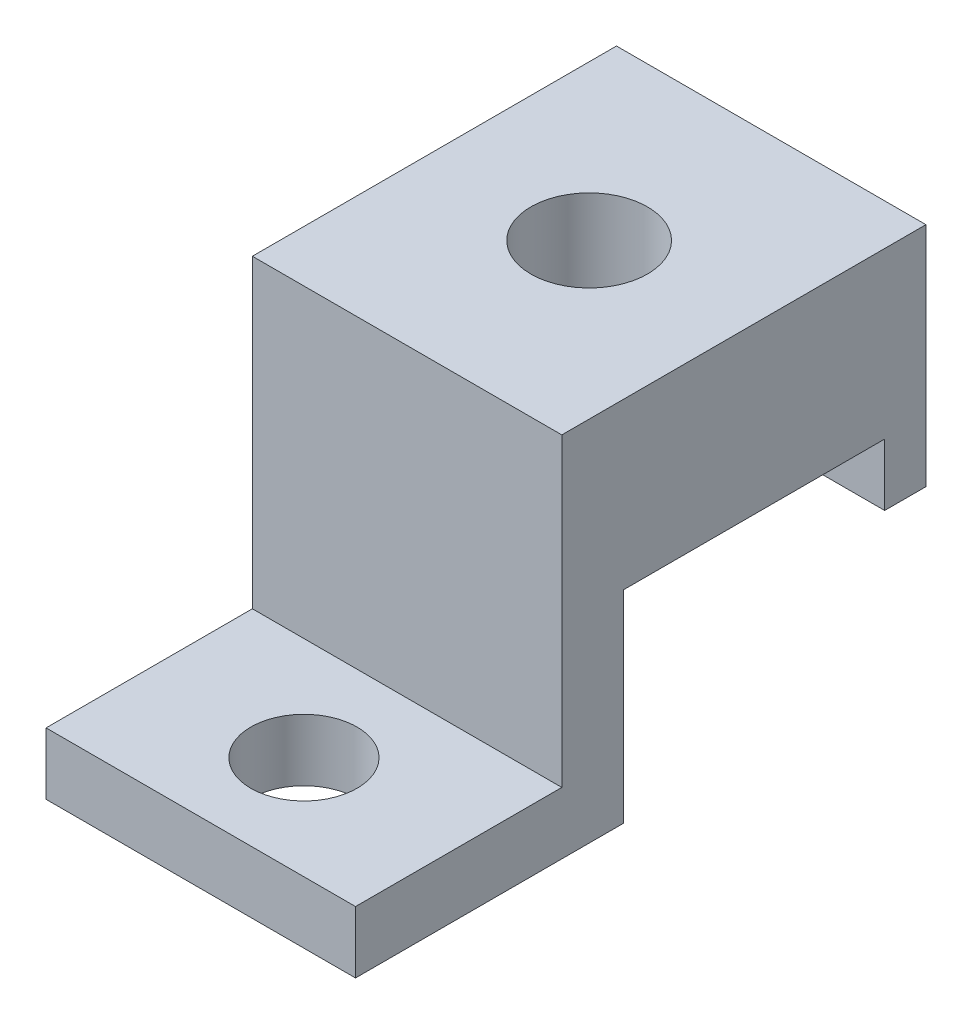
ISO-10303-21;
HEADER;
FILE_DESCRIPTION(('STEP AP214'),'2;1');
FILE_NAME('part.step','',(''),(''),'','','');
FILE_SCHEMA(('AUTOMOTIVE_DESIGN { 1 0 10303 214 1 1 1 1 }'));
ENDSEC;
DATA;
#1=APPLICATION_CONTEXT('core data for automotive mechanical design processes');
#2=APPLICATION_PROTOCOL_DEFINITION('international standard','automotive_design',2000,#1);
#3=PRODUCT_CONTEXT('',#1,'mechanical');
#4=PRODUCT('Part','Part','',(#3));
#5=PRODUCT_RELATED_PRODUCT_CATEGORY('part','',(#4));
#6=PRODUCT_DEFINITION_FORMATION('','',#4);
#7=PRODUCT_DEFINITION_CONTEXT('part definition',#1,'design');
#8=PRODUCT_DEFINITION('design','',#6,#7);
#9=PRODUCT_DEFINITION_SHAPE('','',#8);
#10=(LENGTH_UNIT() NAMED_UNIT(*) SI_UNIT(.MILLI.,.METRE.));
#11=(NAMED_UNIT(*) PLANE_ANGLE_UNIT() SI_UNIT($,.RADIAN.));
#12=(NAMED_UNIT(*) SI_UNIT($,.STERADIAN.) SOLID_ANGLE_UNIT());
#13=UNCERTAINTY_MEASURE_WITH_UNIT(LENGTH_MEASURE(1.E-05),#10,'distance_accuracy_value','');
#14=(GEOMETRIC_REPRESENTATION_CONTEXT(3) GLOBAL_UNCERTAINTY_ASSIGNED_CONTEXT((#13)) GLOBAL_UNIT_ASSIGNED_CONTEXT((#10,
#11,#12)) REPRESENTATION_CONTEXT('',''));
#15=CARTESIAN_POINT('',(0.,0.,0.));
#16=DIRECTION('',(0.,0.,1.));
#17=DIRECTION('',(1.,0.,0.));
#18=AXIS2_PLACEMENT_3D('',#15,#16,#17);
#19=CARTESIAN_POINT('',(15.,3.,0.));
#20=DIRECTION('',(0.,0.,-1.));
#21=DIRECTION('',(0.,1.,0.));
#22=AXIS2_PLACEMENT_3D('',#19,#20,#21);
#23=PLANE('',#22);
#24=DIRECTION('',(0.,-1.,0.));
#25=VECTOR('',#24,1.);
#26=CARTESIAN_POINT('',(0.,3.,0.));
#27=LINE('',#26,#25);
#28=CARTESIAN_POINT('',(0.,3.,0.));
#29=VERTEX_POINT('',#28);
#30=CARTESIAN_POINT('',(0.,0.,0.));
#31=VERTEX_POINT('',#30);
#32=EDGE_CURVE('E156',#29,#31,#27,.T.);
#33=ORIENTED_EDGE('',*,*,#32,.T.);
#34=DIRECTION('',(-1.,0.,0.));
#35=VECTOR('',#34,1.);
#36=CARTESIAN_POINT('',(15.,0.,0.));
#37=LINE('',#36,#35);
#38=CARTESIAN_POINT('',(15.,0.,0.));
#39=VERTEX_POINT('',#38);
#40=EDGE_CURVE('E11',#39,#31,#37,.T.);
#41=ORIENTED_EDGE('',*,*,#40,.F.);
#42=DIRECTION('',(0.,-1.,0.));
#43=VECTOR('',#42,1.);
#44=CARTESIAN_POINT('',(15.,3.,0.));
#45=LINE('',#44,#43);
#46=CARTESIAN_POINT('',(15.,3.,0.));
#47=VERTEX_POINT('',#46);
#48=EDGE_CURVE('E142',#47,#39,#45,.T.);
#49=ORIENTED_EDGE('',*,*,#48,.F.);
#50=DIRECTION('',(-1.,0.,0.));
#51=VECTOR('',#50,1.);
#52=CARTESIAN_POINT('',(15.,3.,0.));
#53=LINE('',#52,#51);
#54=EDGE_CURVE('E173',#47,#29,#53,.T.);
#55=ORIENTED_EDGE('',*,*,#54,.T.);
#56=EDGE_LOOP('',(#33,#41,#49,#55));
#57=FACE_BOUND('',#56,.T.);
#58=ADVANCED_FACE('F35',(#57),#23,.F.);
#59=CARTESIAN_POINT('',(15.,0.,0.));
#60=DIRECTION('',(0.,1.,0.));
#61=DIRECTION('',(0.,0.,1.));
#62=AXIS2_PLACEMENT_3D('',#59,#60,#61);
#63=PLANE('',#62);
#64=CARTESIAN_POINT('',(7.5,0.,-5.));
#65=DIRECTION('',(0.,1.,0.));
#66=DIRECTION('',(0.,0.,1.));
#67=AXIS2_PLACEMENT_3D('',#64,#65,#66);
#68=CIRCLE('',#67,2.575);
#69=CARTESIAN_POINT('',(7.5,0.,-2.425));
#70=VERTEX_POINT('',#69);
#71=EDGE_CURVE('E190',#70,#70,#68,.T.);
#72=ORIENTED_EDGE('',*,*,#71,.T.);
#73=EDGE_LOOP('',(#72));
#74=FACE_BOUND('',#73,.T.);
#75=DIRECTION('',(0.,0.,-1.));
#76=VECTOR('',#75,1.);
#77=CARTESIAN_POINT('',(0.,0.,0.));
#78=LINE('',#77,#76);
#79=CARTESIAN_POINT('',(0.,0.,-13.));
#80=VERTEX_POINT('',#79);
#81=EDGE_CURVE('E160',#31,#80,#78,.T.);
#82=ORIENTED_EDGE('',*,*,#81,.T.);
#83=DIRECTION('',(-1.,0.,0.));
#84=VECTOR('',#83,1.);
#85=CARTESIAN_POINT('',(15.,0.,-13.));
#86=LINE('',#85,#84);
#87=CARTESIAN_POINT('',(15.,0.,-13.));
#88=VERTEX_POINT('',#87);
#89=EDGE_CURVE('E44',#88,#80,#86,.T.);
#90=ORIENTED_EDGE('',*,*,#89,.F.);
#91=DIRECTION('',(0.,0.,-1.));
#92=VECTOR('',#91,1.);
#93=CARTESIAN_POINT('',(15.,0.,0.));
#94=LINE('',#93,#92);
#95=EDGE_CURVE('E88',#39,#88,#94,.T.);
#96=ORIENTED_EDGE('',*,*,#95,.F.);
#97=ORIENTED_EDGE('',*,*,#40,.T.);
#98=EDGE_LOOP('',(#82,#90,#96,#97));
#99=FACE_BOUND('',#98,.T.);
#100=ADVANCED_FACE('F254',(#74,#99),#63,.F.);
#101=CARTESIAN_POINT('',(15.,0.,-13.));
#102=DIRECTION('',(0.,0.,1.));
#103=DIRECTION('',(1.,0.,0.));
#104=AXIS2_PLACEMENT_3D('',#101,#102,#103);
#105=PLANE('',#104);
#106=DIRECTION('',(0.,1.,0.));
#107=VECTOR('',#106,1.);
#108=CARTESIAN_POINT('',(0.,0.,-13.));
#109=LINE('',#108,#107);
#110=CARTESIAN_POINT('',(0.,9.8,-13.));
#111=VERTEX_POINT('',#110);
#112=EDGE_CURVE('E165',#80,#111,#109,.T.);
#113=ORIENTED_EDGE('',*,*,#112,.T.);
#114=DIRECTION('',(-1.,0.,0.));
#115=VECTOR('',#114,1.);
#116=CARTESIAN_POINT('',(15.,9.8,-13.));
#117=LINE('',#116,#115);
#118=CARTESIAN_POINT('',(15.,9.8,-13.));
#119=VERTEX_POINT('',#118);
#120=EDGE_CURVE('E121',#119,#111,#117,.T.);
#121=ORIENTED_EDGE('',*,*,#120,.F.);
#122=DIRECTION('',(0.,1.,0.));
#123=VECTOR('',#122,1.);
#124=CARTESIAN_POINT('',(15.,0.,-13.));
#125=LINE('',#124,#123);
#126=EDGE_CURVE('E107',#88,#119,#125,.T.);
#127=ORIENTED_EDGE('',*,*,#126,.F.);
#128=ORIENTED_EDGE('',*,*,#89,.T.);
#129=EDGE_LOOP('',(#113,#121,#127,#128));
#130=FACE_BOUND('',#129,.T.);
#131=ADVANCED_FACE('F255',(#130),#105,.F.);
#132=CARTESIAN_POINT('',(15.,9.8,-13.));
#133=DIRECTION('',(0.,1.,0.));
#134=DIRECTION('',(0.,0.,1.));
#135=AXIS2_PLACEMENT_3D('',#132,#133,#134);
#136=PLANE('',#135);
#137=CARTESIAN_POINT('',(7.5,9.8,-18.825));
#138=DIRECTION('',(0.,1.,0.));
#139=DIRECTION('',(0.,0.,1.));
#140=AXIS2_PLACEMENT_3D('',#137,#138,#139);
#141=CIRCLE('',#140,1.75);
#142=CARTESIAN_POINT('',(7.5,9.8,-17.075));
#143=VERTEX_POINT('',#142);
#144=EDGE_CURVE('E212',#143,#143,#141,.T.);
#145=ORIENTED_EDGE('',*,*,#144,.T.);
#146=EDGE_LOOP('',(#145));
#147=FACE_BOUND('',#146,.T.);
#148=DIRECTION('',(0.,0.,-1.));
#149=VECTOR('',#148,1.);
#150=CARTESIAN_POINT('',(0.,9.8,-13.));
#151=LINE('',#150,#149);
#152=CARTESIAN_POINT('',(0.,9.8,-25.65));
#153=VERTEX_POINT('',#152);
#154=EDGE_CURVE('E117',#111,#153,#151,.T.);
#155=ORIENTED_EDGE('',*,*,#154,.T.);
#156=DIRECTION('',(-1.,0.,0.));
#157=VECTOR('',#156,1.);
#158=CARTESIAN_POINT('',(15.,9.8,-25.65));
#159=LINE('',#158,#157);
#160=CARTESIAN_POINT('',(15.,9.8,-25.65));
#161=VERTEX_POINT('',#160);
#162=EDGE_CURVE('E114',#161,#153,#159,.T.);
#163=ORIENTED_EDGE('',*,*,#162,.F.);
#164=DIRECTION('',(0.,0.,-1.));
#165=VECTOR('',#164,1.);
#166=CARTESIAN_POINT('',(15.,9.8,-13.));
#167=LINE('',#166,#165);
#168=EDGE_CURVE('E98',#119,#161,#167,.T.);
#169=ORIENTED_EDGE('',*,*,#168,.F.);
#170=ORIENTED_EDGE('',*,*,#120,.T.);
#171=EDGE_LOOP('',(#155,#163,#169,#170));
#172=FACE_BOUND('',#171,.T.);
#173=ADVANCED_FACE('F115',(#147,#172),#136,.F.);
#174=CARTESIAN_POINT('',(15.,12.8,-10.));
#175=DIRECTION('',(0.,0.,-1.));
#176=DIRECTION('',(0.,1.,0.));
#177=AXIS2_PLACEMENT_3D('',#174,#175,#176);
#178=PLANE('',#177);
#179=DIRECTION('',(0.,-1.,0.));
#180=VECTOR('',#179,1.);
#181=CARTESIAN_POINT('',(0.,12.8,-10.));
#182=LINE('',#181,#180);
#183=CARTESIAN_POINT('',(0.,17.8,-10.));
#184=VERTEX_POINT('',#183);
#185=CARTESIAN_POINT('',(0.,3.,-10.));
#186=VERTEX_POINT('',#185);
#187=EDGE_CURVE('E74',#184,#186,#182,.T.);
#188=ORIENTED_EDGE('',*,*,#187,.T.);
#189=DIRECTION('',(-1.,0.,0.));
#190=VECTOR('',#189,1.);
#191=CARTESIAN_POINT('',(15.,3.,-10.));
#192=LINE('',#191,#190);
#193=CARTESIAN_POINT('',(15.,3.,-10.));
#194=VERTEX_POINT('',#193);
#195=EDGE_CURVE('E122',#194,#186,#192,.T.);
#196=ORIENTED_EDGE('',*,*,#195,.F.);
#197=DIRECTION('',(0.,-1.,0.));
#198=VECTOR('',#197,1.);
#199=CARTESIAN_POINT('',(15.,12.8,-10.));
#200=LINE('',#199,#198);
#201=CARTESIAN_POINT('',(15.,17.8,-10.));
#202=VERTEX_POINT('',#201);
#203=EDGE_CURVE('E111',#202,#194,#200,.T.);
#204=ORIENTED_EDGE('',*,*,#203,.F.);
#205=DIRECTION('',(1.,0.,0.));
#206=VECTOR('',#205,1.);
#207=CARTESIAN_POINT('',(-18.3445495992679,17.8,-10.));
#208=LINE('',#207,#206);
#209=EDGE_CURVE('E200',#184,#202,#208,.T.);
#210=ORIENTED_EDGE('',*,*,#209,.F.);
#211=EDGE_LOOP('',(#188,#196,#204,#210));
#212=FACE_BOUND('',#211,.T.);
#213=ADVANCED_FACE('F249',(#212),#178,.F.);
#214=CARTESIAN_POINT('',(15.,3.,-10.));
#215=DIRECTION('',(0.,-1.,0.));
#216=DIRECTION('',(0.,0.,-1.));
#217=AXIS2_PLACEMENT_3D('',#214,#215,#216);
#218=PLANE('',#217);
#219=CARTESIAN_POINT('',(7.5,3.,-5.));
#220=DIRECTION('',(0.,1.,0.));
#221=DIRECTION('',(0.,0.,1.));
#222=AXIS2_PLACEMENT_3D('',#219,#220,#221);
#223=CIRCLE('',#222,2.575);
#224=CARTESIAN_POINT('',(7.5,3.,-2.425));
#225=VERTEX_POINT('',#224);
#226=EDGE_CURVE('E146',#225,#225,#223,.T.);
#227=ORIENTED_EDGE('',*,*,#226,.F.);
#228=EDGE_LOOP('',(#227));
#229=FACE_BOUND('',#228,.T.);
#230=DIRECTION('',(0.,0.,1.));
#231=VECTOR('',#230,1.);
#232=CARTESIAN_POINT('',(0.,3.,-10.));
#233=LINE('',#232,#231);
#234=EDGE_CURVE('E80',#186,#29,#233,.T.);
#235=ORIENTED_EDGE('',*,*,#234,.T.);
#236=ORIENTED_EDGE('',*,*,#54,.F.);
#237=DIRECTION('',(0.,0.,1.));
#238=VECTOR('',#237,1.);
#239=CARTESIAN_POINT('',(15.,3.,-10.));
#240=LINE('',#239,#238);
#241=EDGE_CURVE('E53',#194,#47,#240,.T.);
#242=ORIENTED_EDGE('',*,*,#241,.F.);
#243=ORIENTED_EDGE('',*,*,#195,.T.);
#244=EDGE_LOOP('',(#235,#236,#242,#243));
#245=FACE_BOUND('',#244,.T.);
#246=ADVANCED_FACE('F284',(#229,#245),#218,.F.);
#247=CARTESIAN_POINT('',(15.,0.,0.));
#248=DIRECTION('',(1.,0.,0.));
#249=DIRECTION('',(0.,0.,-1.));
#250=AXIS2_PLACEMENT_3D('',#247,#248,#249);
#251=PLANE('',#250);
#252=ORIENTED_EDGE('',*,*,#48,.T.);
#253=ORIENTED_EDGE('',*,*,#95,.T.);
#254=ORIENTED_EDGE('',*,*,#126,.T.);
#255=ORIENTED_EDGE('',*,*,#168,.T.);
#256=DIRECTION('',(0.,-1.,0.));
#257=VECTOR('',#256,1.);
#258=CARTESIAN_POINT('',(15.,12.8,-25.65));
#259=LINE('',#258,#257);
#260=CARTESIAN_POINT('',(15.,6.8,-25.65));
#261=VERTEX_POINT('',#260);
#262=EDGE_CURVE('E104',#161,#261,#259,.T.);
#263=ORIENTED_EDGE('',*,*,#262,.T.);
#264=DIRECTION('',(0.,0.,-1.));
#265=VECTOR('',#264,1.);
#266=CARTESIAN_POINT('',(15.,6.8,-25.65));
#267=LINE('',#266,#265);
#268=CARTESIAN_POINT('',(15.,6.8,-27.65));
#269=VERTEX_POINT('',#268);
#270=EDGE_CURVE('E128',#261,#269,#267,.T.);
#271=ORIENTED_EDGE('',*,*,#270,.T.);
#272=DIRECTION('',(0.,1.,0.));
#273=VECTOR('',#272,1.);
#274=CARTESIAN_POINT('',(15.,12.8,-27.65));
#275=LINE('',#274,#273);
#276=CARTESIAN_POINT('',(15.,17.8,-27.65));
#277=VERTEX_POINT('',#276);
#278=EDGE_CURVE('E131',#269,#277,#275,.T.);
#279=ORIENTED_EDGE('',*,*,#278,.T.);
#280=DIRECTION('',(0.,0.,1.));
#281=VECTOR('',#280,1.);
#282=CARTESIAN_POINT('',(15.,17.8,-10.));
#283=LINE('',#282,#281);
#284=EDGE_CURVE('E201',#277,#202,#283,.T.);
#285=ORIENTED_EDGE('',*,*,#284,.T.);
#286=ORIENTED_EDGE('',*,*,#203,.T.);
#287=ORIENTED_EDGE('',*,*,#241,.T.);
#288=EDGE_LOOP('',(#252,#253,#254,#255,#263,#271,#279,#285,#286,#287));
#289=FACE_BOUND('',#288,.T.);
#290=ADVANCED_FACE('F100',(#289),#251,.T.);
#291=CARTESIAN_POINT('',(0.,0.,0.));
#292=DIRECTION('',(1.,0.,0.));
#293=DIRECTION('',(0.,0.,-1.));
#294=AXIS2_PLACEMENT_3D('',#291,#292,#293);
#295=PLANE('',#294);
#296=ORIENTED_EDGE('',*,*,#32,.F.);
#297=ORIENTED_EDGE('',*,*,#234,.F.);
#298=ORIENTED_EDGE('',*,*,#187,.F.);
#299=DIRECTION('',(0.,0.,-1.));
#300=VECTOR('',#299,1.);
#301=CARTESIAN_POINT('',(0.,17.8,-10.));
#302=LINE('',#301,#300);
#303=CARTESIAN_POINT('',(0.,17.8,-27.65));
#304=VERTEX_POINT('',#303);
#305=EDGE_CURVE('E195',#184,#304,#302,.T.);
#306=ORIENTED_EDGE('',*,*,#305,.T.);
#307=DIRECTION('',(0.,1.,0.));
#308=VECTOR('',#307,1.);
#309=CARTESIAN_POINT('',(0.,12.8,-27.65));
#310=LINE('',#309,#308);
#311=CARTESIAN_POINT('',(0.,6.8,-27.65));
#312=VERTEX_POINT('',#311);
#313=EDGE_CURVE('E129',#312,#304,#310,.T.);
#314=ORIENTED_EDGE('',*,*,#313,.F.);
#315=DIRECTION('',(0.,0.,-1.));
#316=VECTOR('',#315,1.);
#317=CARTESIAN_POINT('',(0.,6.8,-25.65));
#318=LINE('',#317,#316);
#319=CARTESIAN_POINT('',(0.,6.8,-25.65));
#320=VERTEX_POINT('',#319);
#321=EDGE_CURVE('E134',#320,#312,#318,.T.);
#322=ORIENTED_EDGE('',*,*,#321,.F.);
#323=DIRECTION('',(0.,-1.,0.));
#324=VECTOR('',#323,1.);
#325=CARTESIAN_POINT('',(0.,12.8,-25.65));
#326=LINE('',#325,#324);
#327=EDGE_CURVE('E139',#153,#320,#326,.T.);
#328=ORIENTED_EDGE('',*,*,#327,.F.);
#329=ORIENTED_EDGE('',*,*,#154,.F.);
#330=ORIENTED_EDGE('',*,*,#112,.F.);
#331=ORIENTED_EDGE('',*,*,#81,.F.);
#332=EDGE_LOOP('',(#296,#297,#298,#306,#314,#322,#328,#329,#330,#331));
#333=FACE_BOUND('',#332,.T.);
#334=ADVANCED_FACE('F186',(#333),#295,.F.);
#335=CARTESIAN_POINT('',(15.,12.8,-25.65));
#336=DIRECTION('',(0.,0.,-1.));
#337=DIRECTION('',(-1.,0.,0.));
#338=AXIS2_PLACEMENT_3D('',#335,#336,#337);
#339=PLANE('',#338);
#340=ORIENTED_EDGE('',*,*,#262,.F.);
#341=ORIENTED_EDGE('',*,*,#162,.T.);
#342=ORIENTED_EDGE('',*,*,#327,.T.);
#343=DIRECTION('',(-1.,0.,0.));
#344=VECTOR('',#343,1.);
#345=CARTESIAN_POINT('',(15.,6.8,-25.65));
#346=LINE('',#345,#344);
#347=EDGE_CURVE('E127',#261,#320,#346,.T.);
#348=ORIENTED_EDGE('',*,*,#347,.F.);
#349=EDGE_LOOP('',(#340,#341,#342,#348));
#350=FACE_BOUND('',#349,.T.);
#351=ADVANCED_FACE('F125',(#350),#339,.F.);
#352=CARTESIAN_POINT('',(15.,6.8,-25.65));
#353=DIRECTION('',(0.,1.,0.));
#354=DIRECTION('',(0.,0.,1.));
#355=AXIS2_PLACEMENT_3D('',#352,#353,#354);
#356=PLANE('',#355);
#357=ORIENTED_EDGE('',*,*,#321,.T.);
#358=DIRECTION('',(-1.,0.,0.));
#359=VECTOR('',#358,1.);
#360=CARTESIAN_POINT('',(15.,6.8,-27.65));
#361=LINE('',#360,#359);
#362=EDGE_CURVE('E150',#269,#312,#361,.T.);
#363=ORIENTED_EDGE('',*,*,#362,.F.);
#364=ORIENTED_EDGE('',*,*,#270,.F.);
#365=ORIENTED_EDGE('',*,*,#347,.T.);
#366=EDGE_LOOP('',(#357,#363,#364,#365));
#367=FACE_BOUND('',#366,.T.);
#368=ADVANCED_FACE('F279',(#367),#356,.F.);
#369=CARTESIAN_POINT('',(15.,12.8,-27.65));
#370=DIRECTION('',(0.,0.,1.));
#371=DIRECTION('',(1.,0.,0.));
#372=AXIS2_PLACEMENT_3D('',#369,#370,#371);
#373=PLANE('',#372);
#374=ORIENTED_EDGE('',*,*,#313,.T.);
#375=DIRECTION('',(1.,0.,0.));
#376=VECTOR('',#375,1.);
#377=CARTESIAN_POINT('',(-18.3445495992679,17.8,-27.65));
#378=LINE('',#377,#376);
#379=EDGE_CURVE('E197',#304,#277,#378,.T.);
#380=ORIENTED_EDGE('',*,*,#379,.T.);
#381=ORIENTED_EDGE('',*,*,#278,.F.);
#382=ORIENTED_EDGE('',*,*,#362,.T.);
#383=EDGE_LOOP('',(#374,#380,#381,#382));
#384=FACE_BOUND('',#383,.T.);
#385=ADVANCED_FACE('F301',(#384),#373,.F.);
#386=CARTESIAN_POINT('',(7.5,0.,-5.));
#387=DIRECTION('',(0.,1.,0.));
#388=DIRECTION('',(0.,0.,1.));
#389=AXIS2_PLACEMENT_3D('',#386,#387,#388);
#390=CYLINDRICAL_SURFACE('',#389,2.575);
#391=ORIENTED_EDGE('',*,*,#71,.F.);
#392=EDGE_LOOP('',(#391));
#393=FACE_BOUND('',#392,.T.);
#394=ORIENTED_EDGE('',*,*,#226,.T.);
#395=EDGE_LOOP('',(#394));
#396=FACE_BOUND('',#395,.T.);
#397=ADVANCED_FACE('F239',(#393,#396),#390,.F.);
#398=CARTESIAN_POINT('',(-18.3445495992679,17.8,-10.));
#399=DIRECTION('',(0.,1.,0.));
#400=DIRECTION('',(0.,0.,1.));
#401=AXIS2_PLACEMENT_3D('',#398,#399,#400);
#402=PLANE('',#401);
#403=CARTESIAN_POINT('',(7.5,17.8,-18.825));
#404=DIRECTION('',(0.,1.,0.));
#405=DIRECTION('',(0.,0.,1.));
#406=AXIS2_PLACEMENT_3D('',#403,#404,#405);
#407=CIRCLE('',#406,2.825);
#408=CARTESIAN_POINT('',(7.5,17.8,-16.));
#409=VERTEX_POINT('',#408);
#410=EDGE_CURVE('E209',#409,#409,#407,.T.);
#411=ORIENTED_EDGE('',*,*,#410,.F.);
#412=EDGE_LOOP('',(#411));
#413=FACE_BOUND('',#412,.T.);
#414=ORIENTED_EDGE('',*,*,#305,.F.);
#415=ORIENTED_EDGE('',*,*,#209,.T.);
#416=ORIENTED_EDGE('',*,*,#284,.F.);
#417=ORIENTED_EDGE('',*,*,#379,.F.);
#418=EDGE_LOOP('',(#414,#415,#416,#417));
#419=FACE_BOUND('',#418,.T.);
#420=ADVANCED_FACE('F233',(#413,#419),#402,.T.);
#421=CARTESIAN_POINT('',(7.5,12.8,-18.825));
#422=DIRECTION('',(0.,1.,0.));
#423=DIRECTION('',(0.,0.,1.));
#424=AXIS2_PLACEMENT_3D('',#421,#422,#423);
#425=CYLINDRICAL_SURFACE('',#424,2.825);
#426=CARTESIAN_POINT('',(7.5,12.8,-18.825));
#427=DIRECTION('',(0.,1.,0.));
#428=DIRECTION('',(0.,0.,1.));
#429=AXIS2_PLACEMENT_3D('',#426,#427,#428);
#430=CIRCLE('',#429,2.825);
#431=CARTESIAN_POINT('',(7.5,12.8,-16.));
#432=VERTEX_POINT('',#431);
#433=EDGE_CURVE('E206',#432,#432,#430,.T.);
#434=ORIENTED_EDGE('',*,*,#433,.F.);
#435=EDGE_LOOP('',(#434));
#436=FACE_BOUND('',#435,.T.);
#437=ORIENTED_EDGE('',*,*,#410,.T.);
#438=EDGE_LOOP('',(#437));
#439=FACE_BOUND('',#438,.T.);
#440=ADVANCED_FACE('F227',(#436,#439),#425,.F.);
#441=CARTESIAN_POINT('',(7.5,12.8,-18.825));
#442=DIRECTION('',(0.,1.,0.));
#443=DIRECTION('',(0.,0.,1.));
#444=AXIS2_PLACEMENT_3D('',#441,#442,#443);
#445=PLANE('',#444);
#446=CARTESIAN_POINT('',(7.5,12.8,-18.825));
#447=DIRECTION('',(0.,1.,0.));
#448=DIRECTION('',(0.,0.,1.));
#449=AXIS2_PLACEMENT_3D('',#446,#447,#448);
#450=CIRCLE('',#449,1.75);
#451=CARTESIAN_POINT('',(7.5,12.8,-17.075));
#452=VERTEX_POINT('',#451);
#453=EDGE_CURVE('E217',#452,#452,#450,.T.);
#454=ORIENTED_EDGE('',*,*,#453,.F.);
#455=EDGE_LOOP('',(#454));
#456=FACE_BOUND('',#455,.T.);
#457=ORIENTED_EDGE('',*,*,#433,.T.);
#458=EDGE_LOOP('',(#457));
#459=FACE_BOUND('',#458,.T.);
#460=ADVANCED_FACE('F224',(#456,#459),#445,.T.);
#461=CARTESIAN_POINT('',(7.5,0.,-18.825));
#462=DIRECTION('',(0.,1.,0.));
#463=DIRECTION('',(0.,0.,1.));
#464=AXIS2_PLACEMENT_3D('',#461,#462,#463);
#465=CYLINDRICAL_SURFACE('',#464,1.75);
#466=ORIENTED_EDGE('',*,*,#453,.T.);
#467=EDGE_LOOP('',(#466));
#468=FACE_BOUND('',#467,.T.);
#469=ORIENTED_EDGE('',*,*,#144,.F.);
#470=EDGE_LOOP('',(#469));
#471=FACE_BOUND('',#470,.T.);
#472=ADVANCED_FACE('F221',(#468,#471),#465,.F.);
#473=CLOSED_SHELL('',(#58,#100,#131,#173,#213,#246,#290,#334,#351,#368,#385,#397,#420,#440,#460,#472));
#474=MANIFOLD_SOLID_BREP('B2',#473);
#475=ADVANCED_BREP_SHAPE_REPRESENTATION('',(#18,#474),#14);
#476=SHAPE_DEFINITION_REPRESENTATION(#9,#475);
ENDSEC;
END-ISO-10303-21;
